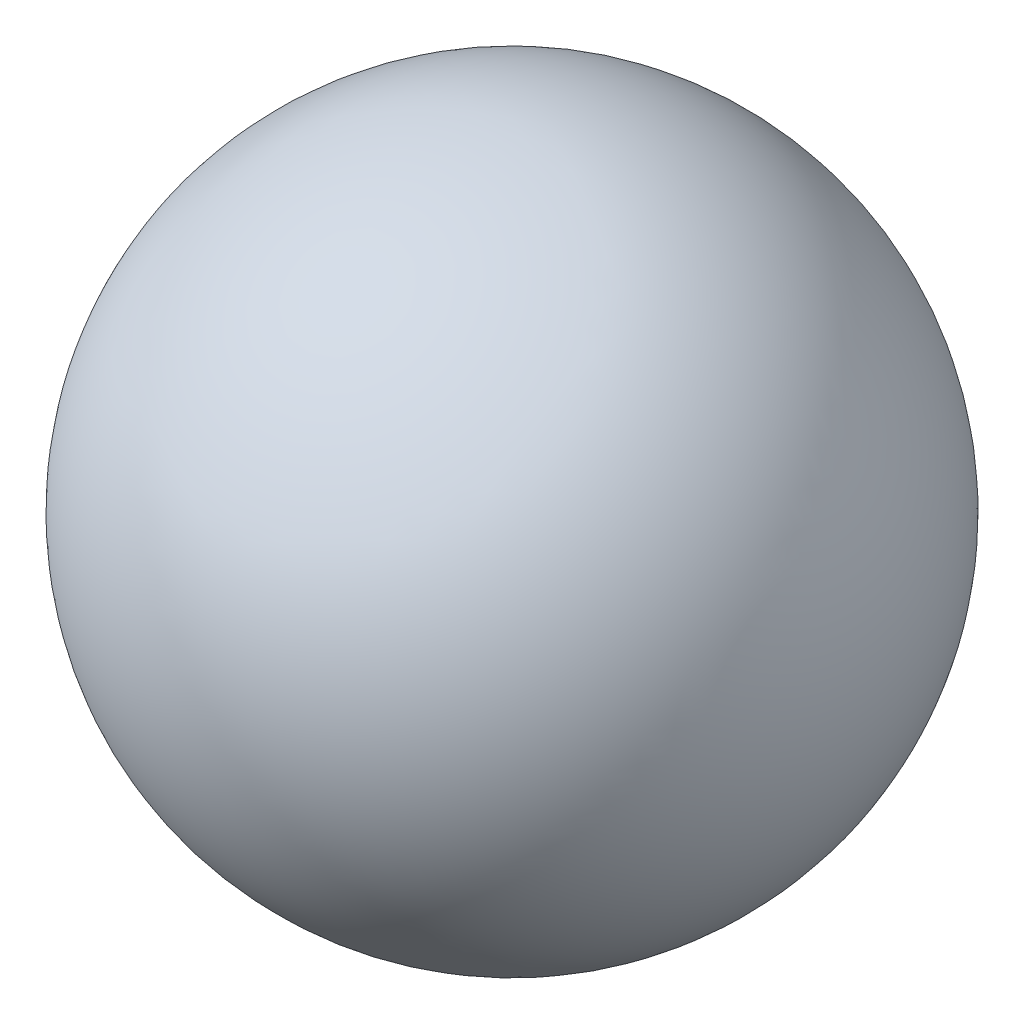
ISO-10303-21;
HEADER;
FILE_DESCRIPTION(('STEP AP214'),'2;1');
FILE_NAME('part.step','',(''),(''),'','','');
FILE_SCHEMA(('AUTOMOTIVE_DESIGN { 1 0 10303 214 1 1 1 1 }'));
ENDSEC;
DATA;
#1=APPLICATION_CONTEXT('core data for automotive mechanical design processes');
#2=APPLICATION_PROTOCOL_DEFINITION('international standard','automotive_design',2000,#1);
#3=PRODUCT_CONTEXT('',#1,'mechanical');
#4=PRODUCT('Part','Part','',(#3));
#5=PRODUCT_RELATED_PRODUCT_CATEGORY('part','',(#4));
#6=PRODUCT_DEFINITION_FORMATION('','',#4);
#7=PRODUCT_DEFINITION_CONTEXT('part definition',#1,'design');
#8=PRODUCT_DEFINITION('design','',#6,#7);
#9=PRODUCT_DEFINITION_SHAPE('','',#8);
#10=(LENGTH_UNIT() NAMED_UNIT(*) SI_UNIT(.MILLI.,.METRE.));
#11=(NAMED_UNIT(*) PLANE_ANGLE_UNIT() SI_UNIT($,.RADIAN.));
#12=(NAMED_UNIT(*) SI_UNIT($,.STERADIAN.) SOLID_ANGLE_UNIT());
#13=UNCERTAINTY_MEASURE_WITH_UNIT(LENGTH_MEASURE(1.E-05),#10,'distance_accuracy_value','');
#14=(GEOMETRIC_REPRESENTATION_CONTEXT(3) GLOBAL_UNCERTAINTY_ASSIGNED_CONTEXT((#13)) GLOBAL_UNIT_ASSIGNED_CONTEXT((#10,
#11,#12)) REPRESENTATION_CONTEXT('',''));
#15=CARTESIAN_POINT('',(0.,0.,0.));
#16=DIRECTION('',(0.,0.,1.));
#17=DIRECTION('',(1.,0.,0.));
#18=AXIS2_PLACEMENT_3D('',#15,#16,#17);
#19=CARTESIAN_POINT('',(0.,0.,0.));
#20=DIRECTION('',(-1.,0.,0.));
#21=DIRECTION('',(0.,0.,-1.));
#22=AXIS2_PLACEMENT_3D('',#19,#20,#21);
#23=SPHERICAL_SURFACE('',#22,50.);
#24=CARTESIAN_POINT('',(-50.,0.,0.));
#25=VERTEX_POINT('',#24);
#26=VERTEX_LOOP('',#25);
#27=FACE_BOUND('',#26,.T.);
#28=ADVANCED_FACE('F33',(#27),#23,.T.);
#29=CLOSED_SHELL('',(#28));
#30=MANIFOLD_SOLID_BREP('B2',#29);
#31=ADVANCED_BREP_SHAPE_REPRESENTATION('',(#18,#30),#14);
#32=SHAPE_DEFINITION_REPRESENTATION(#9,#31);
ENDSEC;
END-ISO-10303-21;
